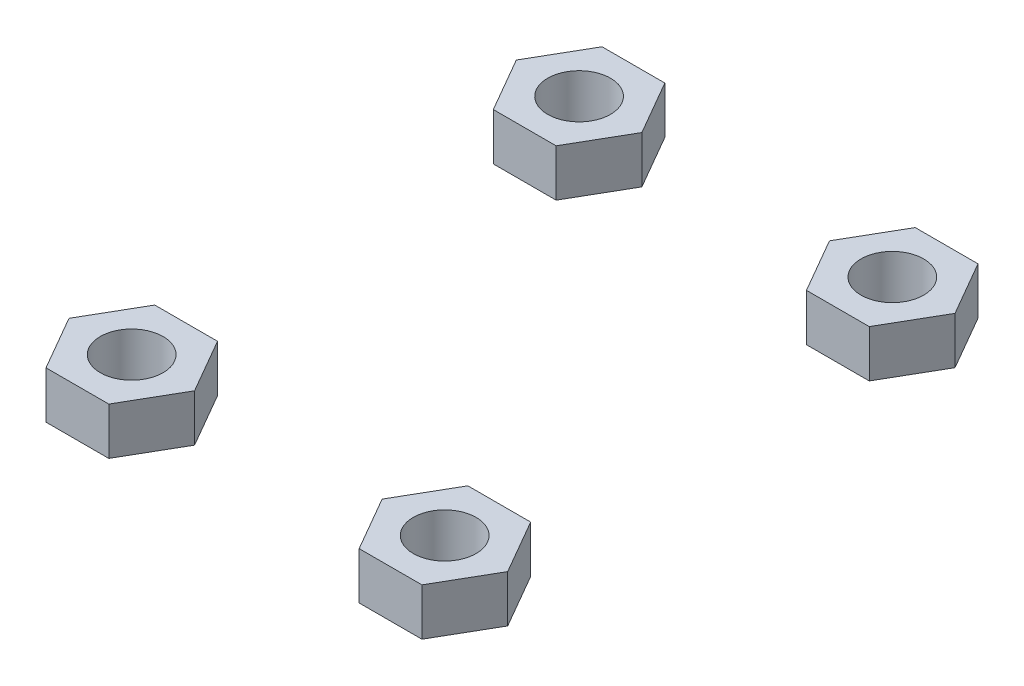
ISO-10303-21;
HEADER;
FILE_DESCRIPTION(('STEP AP214'),'2;1');
FILE_NAME('part.step','',(''),(''),'','','');
FILE_SCHEMA(('AUTOMOTIVE_DESIGN { 1 0 10303 214 1 1 1 1 }'));
ENDSEC;
DATA;
#1=APPLICATION_CONTEXT('core data for automotive mechanical design processes');
#2=APPLICATION_PROTOCOL_DEFINITION('international standard','automotive_design',2000,#1);
#3=PRODUCT_CONTEXT('',#1,'mechanical');
#4=PRODUCT('Part','Part','',(#3));
#5=PRODUCT_RELATED_PRODUCT_CATEGORY('part','',(#4));
#6=PRODUCT_DEFINITION_FORMATION('','',#4);
#7=PRODUCT_DEFINITION_CONTEXT('part definition',#1,'design');
#8=PRODUCT_DEFINITION('design','',#6,#7);
#9=PRODUCT_DEFINITION_SHAPE('','',#8);
#10=(LENGTH_UNIT() NAMED_UNIT(*) SI_UNIT(.MILLI.,.METRE.));
#11=(NAMED_UNIT(*) PLANE_ANGLE_UNIT() SI_UNIT($,.RADIAN.));
#12=(NAMED_UNIT(*) SI_UNIT($,.STERADIAN.) SOLID_ANGLE_UNIT());
#13=UNCERTAINTY_MEASURE_WITH_UNIT(LENGTH_MEASURE(1.E-05),#10,'distance_accuracy_value','');
#14=(GEOMETRIC_REPRESENTATION_CONTEXT(3) GLOBAL_UNCERTAINTY_ASSIGNED_CONTEXT((#13)) GLOBAL_UNIT_ASSIGNED_CONTEXT((#10,
#11,#12)) REPRESENTATION_CONTEXT('',''));
#15=CARTESIAN_POINT('',(0.,0.,0.));
#16=DIRECTION('',(0.,0.,1.));
#17=DIRECTION('',(1.,0.,0.));
#18=AXIS2_PLACEMENT_3D('',#15,#16,#17);
#19=CARTESIAN_POINT('',(0.,6.,50.0688811218834));
#20=DIRECTION('',(0.,0.,1.));
#21=DIRECTION('',(1.,0.,0.));
#22=AXIS2_PLACEMENT_3D('',#19,#20,#21);
#23=PLANE('',#22);
#24=DIRECTION('',(-1.,0.,0.));
#25=VECTOR('',#24,1.);
#26=CARTESIAN_POINT('',(0.,0.,50.0688811218834));
#27=LINE('',#26,#25);
#28=CARTESIAN_POINT('',(43.9005203732391,0.,50.0688811218834));
#29=VERTEX_POINT('',#28);
#30=CARTESIAN_POINT('',(35.9005203732391,0.,50.0688811218834));
#31=VERTEX_POINT('',#30);
#32=EDGE_CURVE('E143',#29,#31,#27,.T.);
#33=ORIENTED_EDGE('',*,*,#32,.T.);
#34=DIRECTION('',(0.,-1.,0.));
#35=VECTOR('',#34,1.);
#36=CARTESIAN_POINT('',(35.9005203732391,6.,50.0688811218834));
#37=LINE('',#36,#35);
#38=CARTESIAN_POINT('',(35.9005203732391,6.,50.0688811218834));
#39=VERTEX_POINT('',#38);
#40=EDGE_CURVE('E12',#39,#31,#37,.T.);
#41=ORIENTED_EDGE('',*,*,#40,.F.);
#42=DIRECTION('',(-1.,0.,0.));
#43=VECTOR('',#42,1.);
#44=CARTESIAN_POINT('',(0.,6.,50.0688811218834));
#45=LINE('',#44,#43);
#46=CARTESIAN_POINT('',(43.9005203732391,6.,50.0688811218834));
#47=VERTEX_POINT('',#46);
#48=EDGE_CURVE('E156',#47,#39,#45,.T.);
#49=ORIENTED_EDGE('',*,*,#48,.F.);
#50=DIRECTION('',(0.,-1.,0.));
#51=VECTOR('',#50,1.);
#52=CARTESIAN_POINT('',(43.9005203732391,6.,50.0688811218834));
#53=LINE('',#52,#51);
#54=EDGE_CURVE('E142',#47,#29,#53,.T.);
#55=ORIENTED_EDGE('',*,*,#54,.T.);
#56=EDGE_LOOP('',(#33,#41,#49,#55));
#57=FACE_BOUND('',#56,.T.);
#58=ADVANCED_FACE('F55',(#57),#23,.F.);
#59=CARTESIAN_POINT('',(48.6058517752364,6.,28.0626016066238));
#60=DIRECTION('',(0.866025403784439,0.,0.5));
#61=DIRECTION('',(0.5,0.,-0.866025403784439));
#62=AXIS2_PLACEMENT_3D('',#59,#60,#61);
#63=PLANE('',#62);
#64=DIRECTION('',(-0.5,0.,0.866025403784439));
#65=VECTOR('',#64,1.);
#66=CARTESIAN_POINT('',(48.6058517752364,0.,28.0626016066238));
#67=LINE('',#66,#65);
#68=CARTESIAN_POINT('',(31.9005203732391,0.,56.9970843521589));
#69=VERTEX_POINT('',#68);
#70=EDGE_CURVE('E146',#31,#69,#67,.T.);
#71=ORIENTED_EDGE('',*,*,#70,.T.);
#72=DIRECTION('',(0.,-1.,0.));
#73=VECTOR('',#72,1.);
#74=CARTESIAN_POINT('',(31.9005203732391,6.,56.9970843521589));
#75=LINE('',#74,#73);
#76=CARTESIAN_POINT('',(31.9005203732391,6.,56.9970843521589));
#77=VERTEX_POINT('',#76);
#78=EDGE_CURVE('E63',#77,#69,#75,.T.);
#79=ORIENTED_EDGE('',*,*,#78,.F.);
#80=DIRECTION('',(-0.5,0.,0.866025403784439));
#81=VECTOR('',#80,1.);
#82=CARTESIAN_POINT('',(48.6058517752364,6.,28.0626016066238));
#83=LINE('',#82,#81);
#84=EDGE_CURVE('E108',#39,#77,#83,.T.);
#85=ORIENTED_EDGE('',*,*,#84,.F.);
#86=ORIENTED_EDGE('',*,*,#40,.T.);
#87=EDGE_LOOP('',(#71,#79,#85,#86));
#88=FACE_BOUND('',#87,.T.);
#89=ADVANCED_FACE('F182',(#88),#63,.F.);
#90=CARTESIAN_POINT('',(-0.755071215377836,6.,0.435940569455732));
#91=DIRECTION('',(0.866025403784438,0.,-0.500000000000001));
#92=DIRECTION('',(-0.500000000000001,0.,-0.866025403784438));
#93=AXIS2_PLACEMENT_3D('',#90,#91,#92);
#94=PLANE('',#93);
#95=DIRECTION('',(0.500000000000001,0.,0.866025403784438));
#96=VECTOR('',#95,1.);
#97=CARTESIAN_POINT('',(-0.755071215377836,0.,0.435940569455732));
#98=LINE('',#97,#96);
#99=CARTESIAN_POINT('',(35.9005203732391,0.,63.9252875824344));
#100=VERTEX_POINT('',#99);
#101=EDGE_CURVE('E148',#69,#100,#98,.T.);
#102=ORIENTED_EDGE('',*,*,#101,.T.);
#103=DIRECTION('',(0.,-1.,0.));
#104=VECTOR('',#103,1.);
#105=CARTESIAN_POINT('',(35.9005203732391,6.,63.9252875824344));
#106=LINE('',#105,#104);
#107=CARTESIAN_POINT('',(35.9005203732391,6.,63.9252875824344));
#108=VERTEX_POINT('',#107);
#109=EDGE_CURVE('E131',#108,#100,#106,.T.);
#110=ORIENTED_EDGE('',*,*,#109,.F.);
#111=DIRECTION('',(0.500000000000001,0.,0.866025403784438));
#112=VECTOR('',#111,1.);
#113=CARTESIAN_POINT('',(-0.755071215377836,6.,0.435940569455732));
#114=LINE('',#113,#112);
#115=EDGE_CURVE('E122',#77,#108,#114,.T.);
#116=ORIENTED_EDGE('',*,*,#115,.F.);
#117=ORIENTED_EDGE('',*,*,#78,.T.);
#118=EDGE_LOOP('',(#102,#110,#116,#117));
#119=FACE_BOUND('',#118,.T.);
#120=ADVANCED_FACE('F162',(#119),#94,.F.);
#121=CARTESIAN_POINT('',(0.,6.,63.9252875824344));
#122=DIRECTION('',(0.,0.,-1.));
#123=DIRECTION('',(-1.,0.,0.));
#124=AXIS2_PLACEMENT_3D('',#121,#122,#123);
#125=PLANE('',#124);
#126=DIRECTION('',(1.,0.,0.));
#127=VECTOR('',#126,1.);
#128=CARTESIAN_POINT('',(0.,0.,63.9252875824344));
#129=LINE('',#128,#127);
#130=CARTESIAN_POINT('',(43.9005203732391,0.,63.9252875824344));
#131=VERTEX_POINT('',#130);
#132=EDGE_CURVE('E130',#100,#131,#129,.T.);
#133=ORIENTED_EDGE('',*,*,#132,.T.);
#134=DIRECTION('',(0.,-1.,0.));
#135=VECTOR('',#134,1.);
#136=CARTESIAN_POINT('',(43.9005203732391,6.,63.9252875824344));
#137=LINE('',#136,#135);
#138=CARTESIAN_POINT('',(43.9005203732391,6.,63.9252875824344));
#139=VERTEX_POINT('',#138);
#140=EDGE_CURVE('E127',#139,#131,#137,.T.);
#141=ORIENTED_EDGE('',*,*,#140,.F.);
#142=DIRECTION('',(1.,0.,0.));
#143=VECTOR('',#142,1.);
#144=CARTESIAN_POINT('',(0.,6.,63.9252875824344));
#145=LINE('',#144,#143);
#146=EDGE_CURVE('E115',#108,#139,#145,.T.);
#147=ORIENTED_EDGE('',*,*,#146,.F.);
#148=ORIENTED_EDGE('',*,*,#109,.T.);
#149=EDGE_LOOP('',(#133,#141,#147,#148));
#150=FACE_BOUND('',#149,.T.);
#151=ADVANCED_FACE('F128',(#150),#125,.F.);
#152=CARTESIAN_POINT('',(60.6058517752364,6.,34.9908048368993));
#153=DIRECTION('',(-0.866025403784438,0.,-0.5));
#154=DIRECTION('',(-0.5,0.,0.866025403784439));
#155=AXIS2_PLACEMENT_3D('',#152,#153,#154);
#156=PLANE('',#155);
#157=DIRECTION('',(0.5,0.,-0.866025403784439));
#158=VECTOR('',#157,1.);
#159=CARTESIAN_POINT('',(60.6058517752364,0.,34.9908048368993));
#160=LINE('',#159,#158);
#161=CARTESIAN_POINT('',(47.9005203732391,0.,56.9970843521589));
#162=VERTEX_POINT('',#161);
#163=EDGE_CURVE('E94',#131,#162,#160,.T.);
#164=ORIENTED_EDGE('',*,*,#163,.T.);
#165=DIRECTION('',(0.,-1.,0.));
#166=VECTOR('',#165,1.);
#167=CARTESIAN_POINT('',(47.9005203732391,6.,56.9970843521589));
#168=LINE('',#167,#166);
#169=CARTESIAN_POINT('',(47.9005203732391,6.,56.9970843521589));
#170=VERTEX_POINT('',#169);
#171=EDGE_CURVE('E132',#170,#162,#168,.T.);
#172=ORIENTED_EDGE('',*,*,#171,.F.);
#173=DIRECTION('',(0.5,0.,-0.866025403784439));
#174=VECTOR('',#173,1.);
#175=CARTESIAN_POINT('',(60.6058517752364,6.,34.9908048368993));
#176=LINE('',#175,#174);
#177=EDGE_CURVE('E120',#139,#170,#176,.T.);
#178=ORIENTED_EDGE('',*,*,#177,.F.);
#179=ORIENTED_EDGE('',*,*,#140,.T.);
#180=EDGE_LOOP('',(#164,#172,#178,#179));
#181=FACE_BOUND('',#180,.T.);
#182=ADVANCED_FACE('F134',(#181),#156,.F.);
#183=CARTESIAN_POINT('',(11.2449287846222,6.,-6.49226266081981));
#184=DIRECTION('',(-0.866025403784439,0.,0.5));
#185=DIRECTION('',(0.5,0.,0.866025403784439));
#186=AXIS2_PLACEMENT_3D('',#183,#184,#185);
#187=PLANE('',#186);
#188=DIRECTION('',(-0.5,0.,-0.866025403784439));
#189=VECTOR('',#188,1.);
#190=CARTESIAN_POINT('',(11.2449287846222,0.,-6.49226266081981));
#191=LINE('',#190,#189);
#192=EDGE_CURVE('E100',#162,#29,#191,.T.);
#193=ORIENTED_EDGE('',*,*,#192,.T.);
#194=ORIENTED_EDGE('',*,*,#54,.F.);
#195=DIRECTION('',(-0.5,0.,-0.866025403784439));
#196=VECTOR('',#195,1.);
#197=CARTESIAN_POINT('',(11.2449287846222,6.,-6.49226266081981));
#198=LINE('',#197,#196);
#199=EDGE_CURVE('E71',#170,#47,#198,.T.);
#200=ORIENTED_EDGE('',*,*,#199,.F.);
#201=ORIENTED_EDGE('',*,*,#171,.T.);
#202=EDGE_LOOP('',(#193,#194,#200,#201));
#203=FACE_BOUND('',#202,.T.);
#204=ADVANCED_FACE('F170',(#203),#187,.F.);
#205=CARTESIAN_POINT('',(39.9005203732391,6.,57.0241807103767));
#206=DIRECTION('',(0.,-1.,0.));
#207=DIRECTION('',(0.,0.,-1.));
#208=AXIS2_PLACEMENT_3D('',#205,#206,#207);
#209=CYLINDRICAL_SURFACE('',#208,3.99999999999999);
#210=CARTESIAN_POINT('',(39.9005203732391,6.,57.0241807103767));
#211=DIRECTION('',(0.,1.,0.));
#212=DIRECTION('',(0.,0.,1.));
#213=AXIS2_PLACEMENT_3D('',#210,#211,#212);
#214=CIRCLE('',#213,3.99999999999999);
#215=CARTESIAN_POINT('',(39.9005203732391,6.,61.0241807103767));
#216=VERTEX_POINT('',#215);
#217=EDGE_CURVE('E136',#216,#216,#214,.F.);
#218=ORIENTED_EDGE('',*,*,#217,.F.);
#219=EDGE_LOOP('',(#218));
#220=FACE_BOUND('',#219,.T.);
#221=CARTESIAN_POINT('',(39.9005203732391,0.,57.0241807103767));
#222=DIRECTION('',(0.,1.,0.));
#223=DIRECTION('',(0.,0.,1.));
#224=AXIS2_PLACEMENT_3D('',#221,#222,#223);
#225=CIRCLE('',#224,3.99999999999999);
#226=CARTESIAN_POINT('',(39.9005203732391,0.,61.0241807103767));
#227=VERTEX_POINT('',#226);
#228=EDGE_CURVE('E153',#227,#227,#225,.F.);
#229=ORIENTED_EDGE('',*,*,#228,.T.);
#230=EDGE_LOOP('',(#229));
#231=FACE_BOUND('',#230,.T.);
#232=ADVANCED_FACE('F172',(#220,#231),#209,.F.);
#233=CARTESIAN_POINT('',(0.,6.,0.));
#234=DIRECTION('',(0.,1.,0.));
#235=DIRECTION('',(0.,0.,1.));
#236=AXIS2_PLACEMENT_3D('',#233,#234,#235);
#237=PLANE('',#236);
#238=ORIENTED_EDGE('',*,*,#48,.T.);
#239=ORIENTED_EDGE('',*,*,#84,.T.);
#240=ORIENTED_EDGE('',*,*,#115,.T.);
#241=ORIENTED_EDGE('',*,*,#146,.T.);
#242=ORIENTED_EDGE('',*,*,#177,.T.);
#243=ORIENTED_EDGE('',*,*,#199,.T.);
#244=EDGE_LOOP('',(#238,#239,#240,#241,#242,#243));
#245=FACE_BOUND('',#244,.T.);
#246=ORIENTED_EDGE('',*,*,#217,.T.);
#247=EDGE_LOOP('',(#246));
#248=FACE_BOUND('',#247,.T.);
#249=ADVANCED_FACE('F117',(#245,#248),#237,.T.);
#250=CARTESIAN_POINT('',(0.,0.,0.));
#251=DIRECTION('',(0.,1.,0.));
#252=DIRECTION('',(0.,0.,1.));
#253=AXIS2_PLACEMENT_3D('',#250,#251,#252);
#254=PLANE('',#253);
#255=ORIENTED_EDGE('',*,*,#32,.F.);
#256=ORIENTED_EDGE('',*,*,#192,.F.);
#257=ORIENTED_EDGE('',*,*,#163,.F.);
#258=ORIENTED_EDGE('',*,*,#132,.F.);
#259=ORIENTED_EDGE('',*,*,#101,.F.);
#260=ORIENTED_EDGE('',*,*,#70,.F.);
#261=EDGE_LOOP('',(#255,#256,#257,#258,#259,#260));
#262=FACE_BOUND('',#261,.T.);
#263=ORIENTED_EDGE('',*,*,#228,.F.);
#264=EDGE_LOOP('',(#263));
#265=FACE_BOUND('',#264,.T.);
#266=ADVANCED_FACE('F165',(#262,#265),#254,.F.);
#267=CLOSED_SHELL('',(#58,#89,#120,#151,#182,#204,#232,#249,#266));
#268=MANIFOLD_SOLID_BREP('B2',#267);
#269=CARTESIAN_POINT('',(30.6804614953071,6.,17.7133727031775));
#270=DIRECTION('',(0.866025403784438,0.,0.500000000000001));
#271=DIRECTION('',(0.500000000000001,0.,-0.866025403784438));
#272=AXIS2_PLACEMENT_3D('',#269,#270,#271);
#273=PLANE('',#272);
#274=DIRECTION('',(-0.500000000000001,0.,0.866025403784438));
#275=VECTOR('',#274,1.);
#276=CARTESIAN_POINT('',(30.6804614953071,0.,17.7133727031775));
#277=LINE('',#276,#275);
#278=CARTESIAN_POINT('',(8.,0.,56.9970843521589));
#279=VERTEX_POINT('',#278);
#280=CARTESIAN_POINT('',(4.,0.,63.9252875824344));
#281=VERTEX_POINT('',#280);
#282=EDGE_CURVE('E354',#279,#281,#277,.T.);
#283=ORIENTED_EDGE('',*,*,#282,.F.);
#284=DIRECTION('',(0.,-1.,0.));
#285=VECTOR('',#284,1.);
#286=CARTESIAN_POINT('',(8.,6.,56.9970843521589));
#287=LINE('',#286,#285);
#288=CARTESIAN_POINT('',(8.,6.,56.9970843521589));
#289=VERTEX_POINT('',#288);
#290=EDGE_CURVE('E53',#289,#279,#287,.T.);
#291=ORIENTED_EDGE('',*,*,#290,.F.);
#292=DIRECTION('',(-0.500000000000001,0.,0.866025403784438));
#293=VECTOR('',#292,1.);
#294=CARTESIAN_POINT('',(30.6804614953071,6.,17.7133727031775));
#295=LINE('',#294,#293);
#296=CARTESIAN_POINT('',(4.,6.,63.9252875824344));
#297=VERTEX_POINT('',#296);
#298=EDGE_CURVE('E458',#289,#297,#295,.T.);
#299=ORIENTED_EDGE('',*,*,#298,.T.);
#300=DIRECTION('',(0.,-1.,0.));
#301=VECTOR('',#300,1.);
#302=CARTESIAN_POINT('',(4.,6.,63.9252875824344));
#303=LINE('',#302,#301);
#304=EDGE_CURVE('E286',#297,#281,#303,.T.);
#305=ORIENTED_EDGE('',*,*,#304,.T.);
#306=EDGE_LOOP('',(#283,#291,#299,#305));
#307=FACE_BOUND('',#306,.T.);
#308=ADVANCED_FACE('F269',(#307),#273,.T.);
#309=CARTESIAN_POINT('',(-18.6804614953071,6.,10.785169472902));
#310=DIRECTION('',(0.866025403784439,0.,-0.5));
#311=DIRECTION('',(-0.5,0.,-0.866025403784439));
#312=AXIS2_PLACEMENT_3D('',#309,#310,#311);
#313=PLANE('',#312);
#314=DIRECTION('',(0.5,0.,0.866025403784439));
#315=VECTOR('',#314,1.);
#316=CARTESIAN_POINT('',(-18.6804614953071,0.,10.785169472902));
#317=LINE('',#316,#315);
#318=CARTESIAN_POINT('',(3.99999999999999,0.,50.0688811218834));
#319=VERTEX_POINT('',#318);
#320=EDGE_CURVE('E356',#319,#279,#317,.T.);
#321=ORIENTED_EDGE('',*,*,#320,.F.);
#322=DIRECTION('',(0.,-1.,0.));
#323=VECTOR('',#322,1.);
#324=CARTESIAN_POINT('',(3.99999999999999,6.,50.0688811218834));
#325=LINE('',#324,#323);
#326=CARTESIAN_POINT('',(3.99999999999999,6.,50.0688811218834));
#327=VERTEX_POINT('',#326);
#328=EDGE_CURVE('E278',#327,#319,#325,.T.);
#329=ORIENTED_EDGE('',*,*,#328,.F.);
#330=DIRECTION('',(0.5,0.,0.866025403784439));
#331=VECTOR('',#330,1.);
#332=CARTESIAN_POINT('',(-18.6804614953071,6.,10.785169472902));
#333=LINE('',#332,#331);
#334=EDGE_CURVE('E460',#327,#289,#333,.T.);
#335=ORIENTED_EDGE('',*,*,#334,.T.);
#336=ORIENTED_EDGE('',*,*,#290,.T.);
#337=EDGE_LOOP('',(#321,#329,#335,#336));
#338=FACE_BOUND('',#337,.T.);
#339=ADVANCED_FACE('F377',(#338),#313,.T.);
#340=CARTESIAN_POINT('',(0.,6.,50.0688811218834));
#341=DIRECTION('',(0.,0.,-1.));
#342=DIRECTION('',(-1.,0.,0.));
#343=AXIS2_PLACEMENT_3D('',#340,#341,#342);
#344=PLANE('',#343);
#345=DIRECTION('',(1.,0.,0.));
#346=VECTOR('',#345,1.);
#347=CARTESIAN_POINT('',(0.,0.,50.0688811218834));
#348=LINE('',#347,#346);
#349=CARTESIAN_POINT('',(-4.,0.,50.0688811218834));
#350=VERTEX_POINT('',#349);
#351=EDGE_CURVE('E359',#350,#319,#348,.T.);
#352=ORIENTED_EDGE('',*,*,#351,.F.);
#353=DIRECTION('',(0.,-1.,0.));
#354=VECTOR('',#353,1.);
#355=CARTESIAN_POINT('',(-4.,6.,50.0688811218834));
#356=LINE('',#355,#354);
#357=CARTESIAN_POINT('',(-4.,6.,50.0688811218834));
#358=VERTEX_POINT('',#357);
#359=EDGE_CURVE('E333',#358,#350,#356,.T.);
#360=ORIENTED_EDGE('',*,*,#359,.F.);
#361=DIRECTION('',(1.,0.,0.));
#362=VECTOR('',#361,1.);
#363=CARTESIAN_POINT('',(0.,6.,50.0688811218834));
#364=LINE('',#363,#362);
#365=EDGE_CURVE('E343',#358,#327,#364,.T.);
#366=ORIENTED_EDGE('',*,*,#365,.T.);
#367=ORIENTED_EDGE('',*,*,#328,.T.);
#368=EDGE_LOOP('',(#352,#360,#366,#367));
#369=FACE_BOUND('',#368,.T.);
#370=ADVANCED_FACE('F374',(#369),#344,.T.);
#371=CARTESIAN_POINT('',(18.6804614953071,6.,10.785169472902));
#372=DIRECTION('',(-0.866025403784439,0.,-0.5));
#373=DIRECTION('',(-0.5,0.,0.866025403784439));
#374=AXIS2_PLACEMENT_3D('',#371,#372,#373);
#375=PLANE('',#374);
#376=DIRECTION('',(0.5,0.,-0.866025403784439));
#377=VECTOR('',#376,1.);
#378=CARTESIAN_POINT('',(18.6804614953071,0.,10.785169472902));
#379=LINE('',#378,#377);
#380=CARTESIAN_POINT('',(-8.,0.,56.9970843521589));
#381=VERTEX_POINT('',#380);
#382=EDGE_CURVE('E329',#381,#350,#379,.T.);
#383=ORIENTED_EDGE('',*,*,#382,.F.);
#384=DIRECTION('',(0.,-1.,0.));
#385=VECTOR('',#384,1.);
#386=CARTESIAN_POINT('',(-8.,6.,56.9970843521589));
#387=LINE('',#386,#385);
#388=CARTESIAN_POINT('',(-8.,6.,56.9970843521589));
#389=VERTEX_POINT('',#388);
#390=EDGE_CURVE('E324',#389,#381,#387,.T.);
#391=ORIENTED_EDGE('',*,*,#390,.F.);
#392=DIRECTION('',(0.5,0.,-0.866025403784439));
#393=VECTOR('',#392,1.);
#394=CARTESIAN_POINT('',(18.6804614953071,6.,10.785169472902));
#395=LINE('',#394,#393);
#396=EDGE_CURVE('E327',#389,#358,#395,.T.);
#397=ORIENTED_EDGE('',*,*,#396,.T.);
#398=ORIENTED_EDGE('',*,*,#359,.T.);
#399=EDGE_LOOP('',(#383,#391,#397,#398));
#400=FACE_BOUND('',#399,.T.);
#401=ADVANCED_FACE('F326',(#400),#375,.T.);
#402=CARTESIAN_POINT('',(-30.6804614953071,6.,17.7133727031775));
#403=DIRECTION('',(-0.866025403784438,0.,0.5));
#404=DIRECTION('',(0.5,0.,0.866025403784438));
#405=AXIS2_PLACEMENT_3D('',#402,#403,#404);
#406=PLANE('',#405);
#407=DIRECTION('',(-0.5,0.,-0.866025403784438));
#408=VECTOR('',#407,1.);
#409=CARTESIAN_POINT('',(-30.6804614953071,0.,17.7133727031775));
#410=LINE('',#409,#408);
#411=CARTESIAN_POINT('',(-4.00000000000001,0.,63.9252875824344));
#412=VERTEX_POINT('',#411);
#413=EDGE_CURVE('E363',#412,#381,#410,.T.);
#414=ORIENTED_EDGE('',*,*,#413,.F.);
#415=DIRECTION('',(0.,-1.,0.));
#416=VECTOR('',#415,1.);
#417=CARTESIAN_POINT('',(-4.00000000000001,6.,63.9252875824344));
#418=LINE('',#417,#416);
#419=CARTESIAN_POINT('',(-4.00000000000001,6.,63.9252875824344));
#420=VERTEX_POINT('',#419);
#421=EDGE_CURVE('E305',#420,#412,#418,.T.);
#422=ORIENTED_EDGE('',*,*,#421,.F.);
#423=DIRECTION('',(-0.5,0.,-0.866025403784438));
#424=VECTOR('',#423,1.);
#425=CARTESIAN_POINT('',(-30.6804614953071,6.,17.7133727031775));
#426=LINE('',#425,#424);
#427=EDGE_CURVE('E340',#420,#389,#426,.T.);
#428=ORIENTED_EDGE('',*,*,#427,.T.);
#429=ORIENTED_EDGE('',*,*,#390,.T.);
#430=EDGE_LOOP('',(#414,#422,#428,#429));
#431=FACE_BOUND('',#430,.T.);
#432=ADVANCED_FACE('F345',(#431),#406,.T.);
#433=CARTESIAN_POINT('',(0.,6.,57.0106325312678));
#434=DIRECTION('',(0.,-1.,0.));
#435=DIRECTION('',(0.,0.,-1.));
#436=AXIS2_PLACEMENT_3D('',#433,#434,#435);
#437=CYLINDRICAL_SURFACE('',#436,3.99999999999999);
#438=CARTESIAN_POINT('',(0.,6.,57.0106325312678));
#439=DIRECTION('',(0.,1.,0.));
#440=DIRECTION('',(0.,0.,1.));
#441=AXIS2_PLACEMENT_3D('',#438,#439,#440);
#442=CIRCLE('',#441,3.99999999999999);
#443=CARTESIAN_POINT('',(0.,6.,61.0106325312678));
#444=VERTEX_POINT('',#443);
#445=EDGE_CURVE('E368',#444,#444,#442,.T.);
#446=ORIENTED_EDGE('',*,*,#445,.T.);
#447=EDGE_LOOP('',(#446));
#448=FACE_BOUND('',#447,.T.);
#449=CARTESIAN_POINT('',(0.,0.,57.0106325312678));
#450=DIRECTION('',(0.,1.,0.));
#451=DIRECTION('',(0.,0.,1.));
#452=AXIS2_PLACEMENT_3D('',#449,#450,#451);
#453=CIRCLE('',#452,3.99999999999999);
#454=CARTESIAN_POINT('',(0.,0.,61.0106325312678));
#455=VERTEX_POINT('',#454);
#456=EDGE_CURVE('E351',#455,#455,#453,.T.);
#457=ORIENTED_EDGE('',*,*,#456,.F.);
#458=EDGE_LOOP('',(#457));
#459=FACE_BOUND('',#458,.T.);
#460=ADVANCED_FACE('F271',(#448,#459),#437,.F.);
#461=CARTESIAN_POINT('',(0.,6.,63.9252875824344));
#462=DIRECTION('',(0.,0.,1.));
#463=DIRECTION('',(1.,0.,0.));
#464=AXIS2_PLACEMENT_3D('',#461,#462,#463);
#465=PLANE('',#464);
#466=DIRECTION('',(-1.,0.,0.));
#467=VECTOR('',#466,1.);
#468=CARTESIAN_POINT('',(0.,0.,63.9252875824344));
#469=LINE('',#468,#467);
#470=EDGE_CURVE('E365',#281,#412,#469,.T.);
#471=ORIENTED_EDGE('',*,*,#470,.F.);
#472=ORIENTED_EDGE('',*,*,#304,.F.);
#473=DIRECTION('',(-1.,0.,0.));
#474=VECTOR('',#473,1.);
#475=CARTESIAN_POINT('',(0.,6.,63.9252875824344));
#476=LINE('',#475,#474);
#477=EDGE_CURVE('E346',#297,#420,#476,.T.);
#478=ORIENTED_EDGE('',*,*,#477,.T.);
#479=ORIENTED_EDGE('',*,*,#421,.T.);
#480=EDGE_LOOP('',(#471,#472,#478,#479));
#481=FACE_BOUND('',#480,.T.);
#482=ADVANCED_FACE('F380',(#481),#465,.T.);
#483=CARTESIAN_POINT('',(0.,6.,0.));
#484=DIRECTION('',(0.,1.,0.));
#485=DIRECTION('',(0.,0.,1.));
#486=AXIS2_PLACEMENT_3D('',#483,#484,#485);
#487=PLANE('',#486);
#488=ORIENTED_EDGE('',*,*,#445,.F.);
#489=EDGE_LOOP('',(#488));
#490=FACE_BOUND('',#489,.T.);
#491=ORIENTED_EDGE('',*,*,#298,.F.);
#492=ORIENTED_EDGE('',*,*,#334,.F.);
#493=ORIENTED_EDGE('',*,*,#365,.F.);
#494=ORIENTED_EDGE('',*,*,#396,.F.);
#495=ORIENTED_EDGE('',*,*,#427,.F.);
#496=ORIENTED_EDGE('',*,*,#477,.F.);
#497=EDGE_LOOP('',(#491,#492,#493,#494,#495,#496));
#498=FACE_BOUND('',#497,.T.);
#499=ADVANCED_FACE('F338',(#490,#498),#487,.T.);
#500=CARTESIAN_POINT('',(0.,0.,0.));
#501=DIRECTION('',(0.,1.,0.));
#502=DIRECTION('',(0.,0.,1.));
#503=AXIS2_PLACEMENT_3D('',#500,#501,#502);
#504=PLANE('',#503);
#505=ORIENTED_EDGE('',*,*,#456,.T.);
#506=EDGE_LOOP('',(#505));
#507=FACE_BOUND('',#506,.T.);
#508=ORIENTED_EDGE('',*,*,#282,.T.);
#509=ORIENTED_EDGE('',*,*,#470,.T.);
#510=ORIENTED_EDGE('',*,*,#413,.T.);
#511=ORIENTED_EDGE('',*,*,#382,.T.);
#512=ORIENTED_EDGE('',*,*,#351,.T.);
#513=ORIENTED_EDGE('',*,*,#320,.T.);
#514=EDGE_LOOP('',(#508,#509,#510,#511,#512,#513));
#515=FACE_BOUND('',#514,.T.);
#516=ADVANCED_FACE('F379',(#507,#515),#504,.F.);
#517=CLOSED_SHELL('',(#308,#339,#370,#401,#432,#460,#482,#499,#516));
#518=MANIFOLD_SOLID_BREP('B6',#517);
#519=CARTESIAN_POINT('',(23.9253902799293,6.,13.813330518584));
#520=DIRECTION('',(-0.866025403784438,0.,-0.5));
#521=DIRECTION('',(-0.5,0.,0.866025403784439));
#522=AXIS2_PLACEMENT_3D('',#519,#520,#521);
#523=PLANE('',#522);
#524=DIRECTION('',(0.5,0.,-0.866025403784438));
#525=VECTOR('',#524,1.);
#526=CARTESIAN_POINT('',(23.9253902799293,0.,13.813330518584));
#527=LINE('',#526,#525);
#528=CARTESIAN_POINT('',(31.9005203732391,0.,0.));
#529=VERTEX_POINT('',#528);
#530=CARTESIAN_POINT('',(35.9005203732391,0.,-6.92820323027551));
#531=VERTEX_POINT('',#530);
#532=EDGE_CURVE('E573',#529,#531,#527,.T.);
#533=ORIENTED_EDGE('',*,*,#532,.F.);
#534=DIRECTION('',(0.,-1.,0.));
#535=VECTOR('',#534,1.);
#536=CARTESIAN_POINT('',(31.9005203732391,6.,0.));
#537=LINE('',#536,#535);
#538=CARTESIAN_POINT('',(31.9005203732391,6.,0.));
#539=VERTEX_POINT('',#538);
#540=EDGE_CURVE('E267',#539,#529,#537,.T.);
#541=ORIENTED_EDGE('',*,*,#540,.F.);
#542=DIRECTION('',(0.5,0.,-0.866025403784438));
#543=VECTOR('',#542,1.);
#544=CARTESIAN_POINT('',(23.9253902799293,6.,13.813330518584));
#545=LINE('',#544,#543);
#546=CARTESIAN_POINT('',(35.9005203732391,6.,-6.92820323027551));
#547=VERTEX_POINT('',#546);
#548=EDGE_CURVE('E688',#539,#547,#545,.T.);
#549=ORIENTED_EDGE('',*,*,#548,.T.);
#550=DIRECTION('',(0.,-1.,0.));
#551=VECTOR('',#550,1.);
#552=CARTESIAN_POINT('',(35.9005203732391,6.,-6.92820323027551));
#553=LINE('',#552,#551);
#554=EDGE_CURVE('E500',#547,#531,#553,.T.);
#555=ORIENTED_EDGE('',*,*,#554,.T.);
#556=EDGE_LOOP('',(#533,#541,#549,#555));
#557=FACE_BOUND('',#556,.T.);
#558=ADVANCED_FACE('F482',(#557),#523,.T.);
#559=CARTESIAN_POINT('',(23.9253902799293,6.,-13.813330518584));
#560=DIRECTION('',(-0.866025403784439,0.,0.5));
#561=DIRECTION('',(0.5,0.,0.866025403784439));
#562=AXIS2_PLACEMENT_3D('',#559,#560,#561);
#563=PLANE('',#562);
#564=DIRECTION('',(-0.5,0.,-0.866025403784439));
#565=VECTOR('',#564,1.);
#566=CARTESIAN_POINT('',(23.9253902799293,0.,-13.813330518584));
#567=LINE('',#566,#565);
#568=CARTESIAN_POINT('',(35.9005203732391,0.,6.92820323027551));
#569=VERTEX_POINT('',#568);
#570=EDGE_CURVE('E576',#569,#529,#567,.T.);
#571=ORIENTED_EDGE('',*,*,#570,.F.);
#572=DIRECTION('',(0.,-1.,0.));
#573=VECTOR('',#572,1.);
#574=CARTESIAN_POINT('',(35.9005203732391,6.,6.92820323027551));
#575=LINE('',#574,#573);
#576=CARTESIAN_POINT('',(35.9005203732391,6.,6.92820323027551));
#577=VERTEX_POINT('',#576);
#578=EDGE_CURVE('E492',#577,#569,#575,.T.);
#579=ORIENTED_EDGE('',*,*,#578,.F.);
#580=DIRECTION('',(-0.5,0.,-0.866025403784439));
#581=VECTOR('',#580,1.);
#582=CARTESIAN_POINT('',(23.9253902799293,6.,-13.813330518584));
#583=LINE('',#582,#581);
#584=EDGE_CURVE('E691',#577,#539,#583,.T.);
#585=ORIENTED_EDGE('',*,*,#584,.T.);
#586=ORIENTED_EDGE('',*,*,#540,.T.);
#587=EDGE_LOOP('',(#571,#579,#585,#586));
#588=FACE_BOUND('',#587,.T.);
#589=ADVANCED_FACE('F606',(#588),#563,.T.);
#590=CARTESIAN_POINT('',(0.,6.,6.92820323027552));
#591=DIRECTION('',(0.,0.,1.));
#592=DIRECTION('',(1.,0.,0.));
#593=AXIS2_PLACEMENT_3D('',#590,#591,#592);
#594=PLANE('',#593);
#595=DIRECTION('',(-1.,0.,0.));
#596=VECTOR('',#595,1.);
#597=CARTESIAN_POINT('',(0.,0.,6.92820323027552));
#598=LINE('',#597,#596);
#599=CARTESIAN_POINT('',(43.9005203732391,0.,6.92820323027551));
#600=VERTEX_POINT('',#599);
#601=EDGE_CURVE('E580',#600,#569,#598,.T.);
#602=ORIENTED_EDGE('',*,*,#601,.F.);
#603=DIRECTION('',(0.,-1.,0.));
#604=VECTOR('',#603,1.);
#605=CARTESIAN_POINT('',(43.9005203732391,6.,6.92820323027551));
#606=LINE('',#605,#604);
#607=CARTESIAN_POINT('',(43.9005203732391,6.,6.92820323027551));
#608=VERTEX_POINT('',#607);
#609=EDGE_CURVE('E548',#608,#600,#606,.T.);
#610=ORIENTED_EDGE('',*,*,#609,.F.);
#611=DIRECTION('',(-1.,0.,0.));
#612=VECTOR('',#611,1.);
#613=CARTESIAN_POINT('',(0.,6.,6.92820323027552));
#614=LINE('',#613,#612);
#615=EDGE_CURVE('E558',#608,#577,#614,.T.);
#616=ORIENTED_EDGE('',*,*,#615,.T.);
#617=ORIENTED_EDGE('',*,*,#578,.T.);
#618=EDGE_LOOP('',(#602,#610,#616,#617));
#619=FACE_BOUND('',#618,.T.);
#620=ADVANCED_FACE('F603',(#619),#594,.T.);
#621=CARTESIAN_POINT('',(35.9253902799293,6.,20.7415337488596));
#622=DIRECTION('',(0.866025403784438,0.,0.5));
#623=DIRECTION('',(0.5,0.,-0.866025403784439));
#624=AXIS2_PLACEMENT_3D('',#621,#622,#623);
#625=PLANE('',#624);
#626=DIRECTION('',(-0.5,0.,0.866025403784439));
#627=VECTOR('',#626,1.);
#628=CARTESIAN_POINT('',(35.9253902799293,0.,20.7415337488596));
#629=LINE('',#628,#627);
#630=CARTESIAN_POINT('',(47.9005203732391,0.,0.));
#631=VERTEX_POINT('',#630);
#632=EDGE_CURVE('E543',#631,#600,#629,.T.);
#633=ORIENTED_EDGE('',*,*,#632,.F.);
#634=DIRECTION('',(0.,-1.,0.));
#635=VECTOR('',#634,1.);
#636=CARTESIAN_POINT('',(47.9005203732391,6.,0.));
#637=LINE('',#636,#635);
#638=CARTESIAN_POINT('',(47.9005203732391,6.,0.));
#639=VERTEX_POINT('',#638);
#640=EDGE_CURVE('E538',#639,#631,#637,.T.);
#641=ORIENTED_EDGE('',*,*,#640,.F.);
#642=DIRECTION('',(-0.5,0.,0.866025403784439));
#643=VECTOR('',#642,1.);
#644=CARTESIAN_POINT('',(35.9253902799293,6.,20.7415337488596));
#645=LINE('',#644,#643);
#646=EDGE_CURVE('E541',#639,#608,#645,.T.);
#647=ORIENTED_EDGE('',*,*,#646,.T.);
#648=ORIENTED_EDGE('',*,*,#609,.T.);
#649=EDGE_LOOP('',(#633,#641,#647,#648));
#650=FACE_BOUND('',#649,.T.);
#651=ADVANCED_FACE('F540',(#650),#625,.T.);
#652=CARTESIAN_POINT('',(35.9253902799293,6.,-20.7415337488595));
#653=DIRECTION('',(0.866025403784439,0.,-0.5));
#654=DIRECTION('',(-0.5,0.,-0.866025403784439));
#655=AXIS2_PLACEMENT_3D('',#652,#653,#654);
#656=PLANE('',#655);
#657=DIRECTION('',(0.5,0.,0.866025403784439));
#658=VECTOR('',#657,1.);
#659=CARTESIAN_POINT('',(35.9253902799293,0.,-20.7415337488595));
#660=LINE('',#659,#658);
#661=CARTESIAN_POINT('',(43.9005203732391,0.,-6.92820323027551));
#662=VERTEX_POINT('',#661);
#663=EDGE_CURVE('E586',#662,#631,#660,.T.);
#664=ORIENTED_EDGE('',*,*,#663,.F.);
#665=DIRECTION('',(0.,-1.,0.));
#666=VECTOR('',#665,1.);
#667=CARTESIAN_POINT('',(43.9005203732391,6.,-6.92820323027551));
#668=LINE('',#667,#666);
#669=CARTESIAN_POINT('',(43.9005203732391,6.,-6.92820323027551));
#670=VERTEX_POINT('',#669);
#671=EDGE_CURVE('E519',#670,#662,#668,.T.);
#672=ORIENTED_EDGE('',*,*,#671,.F.);
#673=DIRECTION('',(0.5,0.,0.866025403784439));
#674=VECTOR('',#673,1.);
#675=CARTESIAN_POINT('',(35.9253902799293,6.,-20.7415337488595));
#676=LINE('',#675,#674);
#677=EDGE_CURVE('E555',#670,#639,#676,.T.);
#678=ORIENTED_EDGE('',*,*,#677,.T.);
#679=ORIENTED_EDGE('',*,*,#640,.T.);
#680=EDGE_LOOP('',(#664,#672,#678,#679));
#681=FACE_BOUND('',#680,.T.);
#682=ADVANCED_FACE('F561',(#681),#656,.T.);
#683=CARTESIAN_POINT('',(39.9005203732391,6.,-0.0135481791088965));
#684=DIRECTION('',(0.,-1.,0.));
#685=DIRECTION('',(0.,0.,-1.));
#686=AXIS2_PLACEMENT_3D('',#683,#684,#685);
#687=CYLINDRICAL_SURFACE('',#686,3.99999999999999);
#688=CARTESIAN_POINT('',(39.9005203732391,6.,-0.0135481791088965));
#689=DIRECTION('',(0.,1.,0.));
#690=DIRECTION('',(0.,0.,1.));
#691=AXIS2_PLACEMENT_3D('',#688,#689,#690);
#692=CIRCLE('',#691,3.99999999999999);
#693=CARTESIAN_POINT('',(39.9005203732391,6.,3.98645182089109));
#694=VERTEX_POINT('',#693);
#695=EDGE_CURVE('E593',#694,#694,#692,.T.);
#696=ORIENTED_EDGE('',*,*,#695,.T.);
#697=EDGE_LOOP('',(#696));
#698=FACE_BOUND('',#697,.T.);
#699=CARTESIAN_POINT('',(39.9005203732391,0.,-0.0135481791088965));
#700=DIRECTION('',(0.,1.,0.));
#701=DIRECTION('',(0.,0.,1.));
#702=AXIS2_PLACEMENT_3D('',#699,#700,#701);
#703=CIRCLE('',#702,3.99999999999999);
#704=CARTESIAN_POINT('',(39.9005203732391,0.,3.98645182089109));
#705=VERTEX_POINT('',#704);
#706=EDGE_CURVE('E569',#705,#705,#703,.T.);
#707=ORIENTED_EDGE('',*,*,#706,.F.);
#708=EDGE_LOOP('',(#707));
#709=FACE_BOUND('',#708,.T.);
#710=ADVANCED_FACE('F484',(#698,#709),#687,.F.);
#711=CARTESIAN_POINT('',(0.,6.,-6.92820323027551));
#712=DIRECTION('',(0.,0.,-1.));
#713=DIRECTION('',(-1.,0.,0.));
#714=AXIS2_PLACEMENT_3D('',#711,#712,#713);
#715=PLANE('',#714);
#716=DIRECTION('',(1.,0.,0.));
#717=VECTOR('',#716,1.);
#718=CARTESIAN_POINT('',(0.,0.,-6.92820323027551));
#719=LINE('',#718,#717);
#720=EDGE_CURVE('E589',#531,#662,#719,.T.);
#721=ORIENTED_EDGE('',*,*,#720,.F.);
#722=ORIENTED_EDGE('',*,*,#554,.F.);
#723=DIRECTION('',(1.,0.,0.));
#724=VECTOR('',#723,1.);
#725=CARTESIAN_POINT('',(0.,6.,-6.92820323027551));
#726=LINE('',#725,#724);
#727=EDGE_CURVE('E563',#547,#670,#726,.T.);
#728=ORIENTED_EDGE('',*,*,#727,.T.);
#729=ORIENTED_EDGE('',*,*,#671,.T.);
#730=EDGE_LOOP('',(#721,#722,#728,#729));
#731=FACE_BOUND('',#730,.T.);
#732=ADVANCED_FACE('F609',(#731),#715,.T.);
#733=CARTESIAN_POINT('',(0.,6.,0.));
#734=DIRECTION('',(0.,1.,0.));
#735=DIRECTION('',(0.,0.,1.));
#736=AXIS2_PLACEMENT_3D('',#733,#734,#735);
#737=PLANE('',#736);
#738=ORIENTED_EDGE('',*,*,#695,.F.);
#739=EDGE_LOOP('',(#738));
#740=FACE_BOUND('',#739,.T.);
#741=ORIENTED_EDGE('',*,*,#548,.F.);
#742=ORIENTED_EDGE('',*,*,#584,.F.);
#743=ORIENTED_EDGE('',*,*,#615,.F.);
#744=ORIENTED_EDGE('',*,*,#646,.F.);
#745=ORIENTED_EDGE('',*,*,#677,.F.);
#746=ORIENTED_EDGE('',*,*,#727,.F.);
#747=EDGE_LOOP('',(#741,#742,#743,#744,#745,#746));
#748=FACE_BOUND('',#747,.T.);
#749=ADVANCED_FACE('F553',(#740,#748),#737,.T.);
#750=CARTESIAN_POINT('',(0.,0.,0.));
#751=DIRECTION('',(0.,1.,0.));
#752=DIRECTION('',(0.,0.,1.));
#753=AXIS2_PLACEMENT_3D('',#750,#751,#752);
#754=PLANE('',#753);
#755=ORIENTED_EDGE('',*,*,#706,.T.);
#756=EDGE_LOOP('',(#755));
#757=FACE_BOUND('',#756,.T.);
#758=ORIENTED_EDGE('',*,*,#532,.T.);
#759=ORIENTED_EDGE('',*,*,#720,.T.);
#760=ORIENTED_EDGE('',*,*,#663,.T.);
#761=ORIENTED_EDGE('',*,*,#632,.T.);
#762=ORIENTED_EDGE('',*,*,#601,.T.);
#763=ORIENTED_EDGE('',*,*,#570,.T.);
#764=EDGE_LOOP('',(#758,#759,#760,#761,#762,#763));
#765=FACE_BOUND('',#764,.T.);
#766=ADVANCED_FACE('F608',(#757,#765),#754,.F.);
#767=CLOSED_SHELL('',(#558,#589,#620,#651,#682,#710,#732,#749,#766));
#768=MANIFOLD_SOLID_BREP('B47',#767);
#769=CARTESIAN_POINT('',(0.,6.,6.92820323027551));
#770=DIRECTION('',(0.,0.,-1.));
#771=DIRECTION('',(-1.,0.,0.));
#772=AXIS2_PLACEMENT_3D('',#769,#770,#771);
#773=PLANE('',#772);
#774=DIRECTION('',(1.,0.,0.));
#775=VECTOR('',#774,1.);
#776=CARTESIAN_POINT('',(0.,0.,6.92820323027551));
#777=LINE('',#776,#775);
#778=CARTESIAN_POINT('',(-4.,0.,6.92820323027551));
#779=VERTEX_POINT('',#778);
#780=CARTESIAN_POINT('',(4.,0.,6.92820323027551));
#781=VERTEX_POINT('',#780);
#782=EDGE_CURVE('E792',#779,#781,#777,.T.);
#783=ORIENTED_EDGE('',*,*,#782,.T.);
#784=DIRECTION('',(0.,-1.,0.));
#785=VECTOR('',#784,1.);
#786=CARTESIAN_POINT('',(4.,6.,6.92820323027551));
#787=LINE('',#786,#785);
#788=CARTESIAN_POINT('',(4.,6.,6.92820323027551));
#789=VERTEX_POINT('',#788);
#790=EDGE_CURVE('E480',#789,#781,#787,.T.);
#791=ORIENTED_EDGE('',*,*,#790,.F.);
#792=DIRECTION('',(1.,0.,0.));
#793=VECTOR('',#792,1.);
#794=CARTESIAN_POINT('',(0.,6.,6.92820323027551));
#795=LINE('',#794,#793);
#796=CARTESIAN_POINT('',(-4.,6.,6.92820323027551));
#797=VERTEX_POINT('',#796);
#798=EDGE_CURVE('E815',#797,#789,#795,.T.);
#799=ORIENTED_EDGE('',*,*,#798,.F.);
#800=DIRECTION('',(0.,-1.,0.));
#801=VECTOR('',#800,1.);
#802=CARTESIAN_POINT('',(-4.,6.,6.92820323027551));
#803=LINE('',#802,#801);
#804=EDGE_CURVE('E785',#797,#779,#803,.T.);
#805=ORIENTED_EDGE('',*,*,#804,.T.);
#806=EDGE_LOOP('',(#783,#791,#799,#805));
#807=FACE_BOUND('',#806,.T.);
#808=ADVANCED_FACE('F704',(#807),#773,.F.);
#809=CARTESIAN_POINT('',(6.,6.,3.46410161513775));
#810=DIRECTION('',(-0.866025403784439,0.,-0.5));
#811=DIRECTION('',(-0.5,0.,0.866025403784439));
#812=AXIS2_PLACEMENT_3D('',#809,#810,#811);
#813=PLANE('',#812);
#814=DIRECTION('',(0.5,0.,-0.866025403784439));
#815=VECTOR('',#814,1.);
#816=CARTESIAN_POINT('',(6.,0.,3.46410161513775));
#817=LINE('',#816,#815);
#818=CARTESIAN_POINT('',(8.,0.,0.));
#819=VERTEX_POINT('',#818);
#820=EDGE_CURVE('E795',#781,#819,#817,.T.);
#821=ORIENTED_EDGE('',*,*,#820,.T.);
#822=DIRECTION('',(0.,-1.,0.));
#823=VECTOR('',#822,1.);
#824=CARTESIAN_POINT('',(8.,6.,0.));
#825=LINE('',#824,#823);
#826=CARTESIAN_POINT('',(8.,6.,0.));
#827=VERTEX_POINT('',#826);
#828=EDGE_CURVE('E713',#827,#819,#825,.T.);
#829=ORIENTED_EDGE('',*,*,#828,.F.);
#830=DIRECTION('',(0.5,0.,-0.866025403784439));
#831=VECTOR('',#830,1.);
#832=CARTESIAN_POINT('',(6.,6.,3.46410161513775));
#833=LINE('',#832,#831);
#834=EDGE_CURVE('E758',#789,#827,#833,.T.);
#835=ORIENTED_EDGE('',*,*,#834,.F.);
#836=ORIENTED_EDGE('',*,*,#790,.T.);
#837=EDGE_LOOP('',(#821,#829,#835,#836));
#838=FACE_BOUND('',#837,.T.);
#839=ADVANCED_FACE('F829',(#838),#813,.F.);
#840=CARTESIAN_POINT('',(6.,6.,-3.46410161513775));
#841=DIRECTION('',(-0.866025403784439,0.,0.5));
#842=DIRECTION('',(0.5,0.,0.866025403784439));
#843=AXIS2_PLACEMENT_3D('',#840,#841,#842);
#844=PLANE('',#843);
#845=DIRECTION('',(-0.5,0.,-0.866025403784439));
#846=VECTOR('',#845,1.);
#847=CARTESIAN_POINT('',(6.,0.,-3.46410161513775));
#848=LINE('',#847,#846);
#849=CARTESIAN_POINT('',(3.99999999999999,0.,-6.92820323027551));
#850=VERTEX_POINT('',#849);
#851=EDGE_CURVE('E797',#819,#850,#848,.T.);
#852=ORIENTED_EDGE('',*,*,#851,.T.);
#853=DIRECTION('',(0.,-1.,0.));
#854=VECTOR('',#853,1.);
#855=CARTESIAN_POINT('',(3.99999999999999,6.,-6.92820323027551));
#856=LINE('',#855,#854);
#857=CARTESIAN_POINT('',(3.99999999999999,6.,-6.92820323027551));
#858=VERTEX_POINT('',#857);
#859=EDGE_CURVE('E780',#858,#850,#856,.T.);
#860=ORIENTED_EDGE('',*,*,#859,.F.);
#861=DIRECTION('',(-0.5,0.,-0.866025403784439));
#862=VECTOR('',#861,1.);
#863=CARTESIAN_POINT('',(6.,6.,-3.46410161513775));
#864=LINE('',#863,#862);
#865=EDGE_CURVE('E771',#827,#858,#864,.T.);
#866=ORIENTED_EDGE('',*,*,#865,.F.);
#867=ORIENTED_EDGE('',*,*,#828,.T.);
#868=EDGE_LOOP('',(#852,#860,#866,#867));
#869=FACE_BOUND('',#868,.T.);
#870=ADVANCED_FACE('F808',(#869),#844,.F.);
#871=CARTESIAN_POINT('',(0.,6.,-6.92820323027551));
#872=DIRECTION('',(0.,0.,1.));
#873=DIRECTION('',(1.,0.,0.));
#874=AXIS2_PLACEMENT_3D('',#871,#872,#873);
#875=PLANE('',#874);
#876=DIRECTION('',(-1.,0.,0.));
#877=VECTOR('',#876,1.);
#878=CARTESIAN_POINT('',(0.,0.,-6.92820323027551));
#879=LINE('',#878,#877);
#880=CARTESIAN_POINT('',(-4.,0.,-6.92820323027551));
#881=VERTEX_POINT('',#880);
#882=EDGE_CURVE('E779',#850,#881,#879,.T.);
#883=ORIENTED_EDGE('',*,*,#882,.T.);
#884=DIRECTION('',(0.,-1.,0.));
#885=VECTOR('',#884,1.);
#886=CARTESIAN_POINT('',(-4.,6.,-6.92820323027551));
#887=LINE('',#886,#885);
#888=CARTESIAN_POINT('',(-4.,6.,-6.92820323027551));
#889=VERTEX_POINT('',#888);
#890=EDGE_CURVE('E776',#889,#881,#887,.T.);
#891=ORIENTED_EDGE('',*,*,#890,.F.);
#892=DIRECTION('',(-1.,0.,0.));
#893=VECTOR('',#892,1.);
#894=CARTESIAN_POINT('',(0.,6.,-6.92820323027551));
#895=LINE('',#894,#893);
#896=EDGE_CURVE('E765',#858,#889,#895,.T.);
#897=ORIENTED_EDGE('',*,*,#896,.F.);
#898=ORIENTED_EDGE('',*,*,#859,.T.);
#899=EDGE_LOOP('',(#883,#891,#897,#898));
#900=FACE_BOUND('',#899,.T.);
#901=ADVANCED_FACE('F777',(#900),#875,.F.);
#902=CARTESIAN_POINT('',(-6.,6.,-3.46410161513775));
#903=DIRECTION('',(0.866025403784439,0.,0.5));
#904=DIRECTION('',(0.5,0.,-0.866025403784439));
#905=AXIS2_PLACEMENT_3D('',#902,#903,#904);
#906=PLANE('',#905);
#907=DIRECTION('',(-0.5,0.,0.866025403784439));
#908=VECTOR('',#907,1.);
#909=CARTESIAN_POINT('',(-6.,0.,-3.46410161513775));
#910=LINE('',#909,#908);
#911=CARTESIAN_POINT('',(-8.,0.,0.));
#912=VERTEX_POINT('',#911);
#913=EDGE_CURVE('E744',#881,#912,#910,.T.);
#914=ORIENTED_EDGE('',*,*,#913,.T.);
#915=DIRECTION('',(0.,-1.,0.));
#916=VECTOR('',#915,1.);
#917=CARTESIAN_POINT('',(-8.,6.,0.));
#918=LINE('',#917,#916);
#919=CARTESIAN_POINT('',(-8.,6.,0.));
#920=VERTEX_POINT('',#919);
#921=EDGE_CURVE('E781',#920,#912,#918,.T.);
#922=ORIENTED_EDGE('',*,*,#921,.F.);
#923=DIRECTION('',(-0.5,0.,0.866025403784439));
#924=VECTOR('',#923,1.);
#925=CARTESIAN_POINT('',(-6.,6.,-3.46410161513775));
#926=LINE('',#925,#924);
#927=EDGE_CURVE('E769',#889,#920,#926,.T.);
#928=ORIENTED_EDGE('',*,*,#927,.F.);
#929=ORIENTED_EDGE('',*,*,#890,.T.);
#930=EDGE_LOOP('',(#914,#922,#928,#929));
#931=FACE_BOUND('',#930,.T.);
#932=ADVANCED_FACE('F783',(#931),#906,.F.);
#933=CARTESIAN_POINT('',(0.,6.,0.));
#934=DIRECTION('',(0.,-1.,0.));
#935=DIRECTION('',(0.,0.,-1.));
#936=AXIS2_PLACEMENT_3D('',#933,#934,#935);
#937=CYLINDRICAL_SURFACE('',#936,4.);
#938=CARTESIAN_POINT('',(0.,6.,0.));
#939=DIRECTION('',(0.,1.,0.));
#940=DIRECTION('',(0.,0.,1.));
#941=AXIS2_PLACEMENT_3D('',#938,#939,#940);
#942=CIRCLE('',#941,4.);
#943=CARTESIAN_POINT('',(0.,6.,4.));
#944=VERTEX_POINT('',#943);
#945=EDGE_CURVE('E802',#944,#944,#942,.T.);
#946=ORIENTED_EDGE('',*,*,#945,.T.);
#947=EDGE_LOOP('',(#946));
#948=FACE_BOUND('',#947,.T.);
#949=CARTESIAN_POINT('',(0.,0.,0.));
#950=DIRECTION('',(0.,1.,0.));
#951=DIRECTION('',(0.,0.,1.));
#952=AXIS2_PLACEMENT_3D('',#949,#950,#951);
#953=CIRCLE('',#952,4.);
#954=CARTESIAN_POINT('',(0.,0.,4.));
#955=VERTEX_POINT('',#954);
#956=EDGE_CURVE('E789',#955,#955,#953,.T.);
#957=ORIENTED_EDGE('',*,*,#956,.F.);
#958=EDGE_LOOP('',(#957));
#959=FACE_BOUND('',#958,.T.);
#960=ADVANCED_FACE('F706',(#948,#959),#937,.F.);
#961=CARTESIAN_POINT('',(-6.,6.,3.46410161513776));
#962=DIRECTION('',(0.866025403784439,0.,-0.5));
#963=DIRECTION('',(-0.5,0.,-0.866025403784439));
#964=AXIS2_PLACEMENT_3D('',#961,#962,#963);
#965=PLANE('',#964);
#966=DIRECTION('',(0.5,0.,0.866025403784439));
#967=VECTOR('',#966,1.);
#968=CARTESIAN_POINT('',(-6.,0.,3.46410161513776));
#969=LINE('',#968,#967);
#970=EDGE_CURVE('E750',#912,#779,#969,.T.);
#971=ORIENTED_EDGE('',*,*,#970,.T.);
#972=ORIENTED_EDGE('',*,*,#804,.F.);
#973=DIRECTION('',(0.5,0.,0.866025403784439));
#974=VECTOR('',#973,1.);
#975=CARTESIAN_POINT('',(-6.,6.,3.46410161513776));
#976=LINE('',#975,#974);
#977=EDGE_CURVE('E721',#920,#797,#976,.T.);
#978=ORIENTED_EDGE('',*,*,#977,.F.);
#979=ORIENTED_EDGE('',*,*,#921,.T.);
#980=EDGE_LOOP('',(#971,#972,#978,#979));
#981=FACE_BOUND('',#980,.T.);
#982=ADVANCED_FACE('F816',(#981),#965,.F.);
#983=CARTESIAN_POINT('',(0.,6.,0.));
#984=DIRECTION('',(0.,1.,0.));
#985=DIRECTION('',(0.,0.,1.));
#986=AXIS2_PLACEMENT_3D('',#983,#984,#985);
#987=PLANE('',#986);
#988=ORIENTED_EDGE('',*,*,#945,.F.);
#989=EDGE_LOOP('',(#988));
#990=FACE_BOUND('',#989,.T.);
#991=ORIENTED_EDGE('',*,*,#798,.T.);
#992=ORIENTED_EDGE('',*,*,#834,.T.);
#993=ORIENTED_EDGE('',*,*,#865,.T.);
#994=ORIENTED_EDGE('',*,*,#896,.T.);
#995=ORIENTED_EDGE('',*,*,#927,.T.);
#996=ORIENTED_EDGE('',*,*,#977,.T.);
#997=EDGE_LOOP('',(#991,#992,#993,#994,#995,#996));
#998=FACE_BOUND('',#997,.T.);
#999=ADVANCED_FACE('F767',(#990,#998),#987,.T.);
#1000=CARTESIAN_POINT('',(0.,0.,0.));
#1001=DIRECTION('',(0.,1.,0.));
#1002=DIRECTION('',(0.,0.,1.));
#1003=AXIS2_PLACEMENT_3D('',#1000,#1001,#1002);
#1004=PLANE('',#1003);
#1005=ORIENTED_EDGE('',*,*,#956,.T.);
#1006=EDGE_LOOP('',(#1005));
#1007=FACE_BOUND('',#1006,.T.);
#1008=ORIENTED_EDGE('',*,*,#782,.F.);
#1009=ORIENTED_EDGE('',*,*,#970,.F.);
#1010=ORIENTED_EDGE('',*,*,#913,.F.);
#1011=ORIENTED_EDGE('',*,*,#882,.F.);
#1012=ORIENTED_EDGE('',*,*,#851,.F.);
#1013=ORIENTED_EDGE('',*,*,#820,.F.);
#1014=EDGE_LOOP('',(#1008,#1009,#1010,#1011,#1012,#1013));
#1015=FACE_BOUND('',#1014,.T.);
#1016=ADVANCED_FACE('F811',(#1007,#1015),#1004,.F.);
#1017=CLOSED_SHELL('',(#808,#839,#870,#901,#932,#960,#982,#999,#1016));
#1018=MANIFOLD_SOLID_BREP('B261',#1017);
#1019=ADVANCED_BREP_SHAPE_REPRESENTATION('',(#18,#268,#518,#768,#1018),#14);
#1020=SHAPE_DEFINITION_REPRESENTATION(#9,#1019);
ENDSEC;
END-ISO-10303-21;
